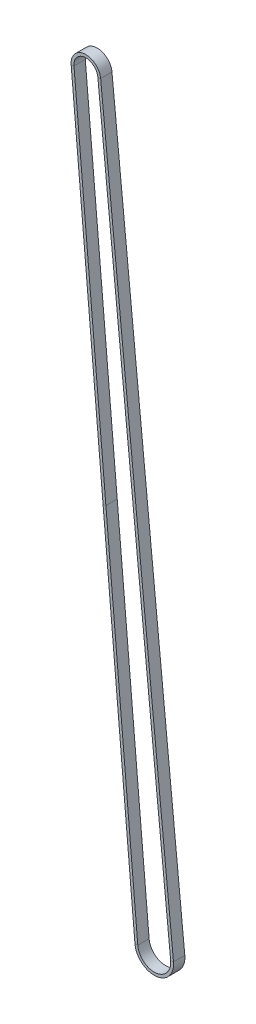
ISO-10303-21;
HEADER;
FILE_DESCRIPTION(('STEP AP214'),'2;1');
FILE_NAME('part.step','',(''),(''),'','','');
FILE_SCHEMA(('AUTOMOTIVE_DESIGN { 1 0 10303 214 1 1 1 1 }'));
ENDSEC;
DATA;
#1=APPLICATION_CONTEXT('core data for automotive mechanical design processes');
#2=APPLICATION_PROTOCOL_DEFINITION('international standard','automotive_design',2000,#1);
#3=PRODUCT_CONTEXT('',#1,'mechanical');
#4=PRODUCT('Part','Part','',(#3));
#5=PRODUCT_RELATED_PRODUCT_CATEGORY('part','',(#4));
#6=PRODUCT_DEFINITION_FORMATION('','',#4);
#7=PRODUCT_DEFINITION_CONTEXT('part definition',#1,'design');
#8=PRODUCT_DEFINITION('design','',#6,#7);
#9=PRODUCT_DEFINITION_SHAPE('','',#8);
#10=(LENGTH_UNIT() NAMED_UNIT(*) SI_UNIT(.MILLI.,.METRE.));
#11=(NAMED_UNIT(*) PLANE_ANGLE_UNIT() SI_UNIT($,.RADIAN.));
#12=(NAMED_UNIT(*) SI_UNIT($,.STERADIAN.) SOLID_ANGLE_UNIT());
#13=UNCERTAINTY_MEASURE_WITH_UNIT(LENGTH_MEASURE(1.E-05),#10,'distance_accuracy_value','');
#14=(GEOMETRIC_REPRESENTATION_CONTEXT(3) GLOBAL_UNCERTAINTY_ASSIGNED_CONTEXT((#13)) GLOBAL_UNIT_ASSIGNED_CONTEXT((#10,
#11,#12)) REPRESENTATION_CONTEXT('',''));
#15=CARTESIAN_POINT('',(0.,0.,0.));
#16=DIRECTION('',(0.,0.,1.));
#17=DIRECTION('',(1.,0.,0.));
#18=AXIS2_PLACEMENT_3D('',#15,#16,#17);
#19=CARTESIAN_POINT('',(-8.71671022717486,-0.762537091199472,-3.));
#20=DIRECTION('',(-0.996195454534337,-0.087147096137086,0.));
#21=DIRECTION('',(0.087147096137086,-0.996195454534337,0.));
#22=AXIS2_PLACEMENT_3D('',#19,#20,#21);
#23=PLANE('',#22);
#24=DIRECTION('',(0.,0.,1.));
#25=VECTOR('',#24,1.);
#26=CARTESIAN_POINT('',(-8.71671022717778,-0.762537091199972,-3.));
#27=LINE('',#26,#25);
#28=CARTESIAN_POINT('',(-8.71671022717483,-0.762537091199717,-3.));
#29=VERTEX_POINT('',#28);
#30=CARTESIAN_POINT('',(-8.71671022717483,-0.762537091199717,3.));
#31=VERTEX_POINT('',#30);
#32=EDGE_CURVE('E167',#29,#31,#27,.T.);
#33=ORIENTED_EDGE('',*,*,#32,.F.);
#34=DIRECTION('',(-0.0871470961370859,0.996195454534336,0.));
#35=VECTOR('',#34,1.);
#36=CARTESIAN_POINT('',(-8.71671022717486,-0.762537091199472,-3.));
#37=LINE('',#36,#35);
#38=CARTESIAN_POINT('',(-25.6232468776201,192.499381086754,-3.));
#39=VERTEX_POINT('',#38);
#40=EDGE_CURVE('E166',#29,#39,#37,.T.);
#41=ORIENTED_EDGE('',*,*,#40,.T.);
#42=DIRECTION('',(0.,0.,1.));
#43=VECTOR('',#42,1.);
#44=CARTESIAN_POINT('',(-25.6232468776201,192.499381086754,-3.));
#45=LINE('',#44,#43);
#46=CARTESIAN_POINT('',(-25.6232468776201,192.499381086754,3.));
#47=VERTEX_POINT('',#46);
#48=EDGE_CURVE('E141',#39,#47,#45,.T.);
#49=ORIENTED_EDGE('',*,*,#48,.T.);
#50=DIRECTION('',(-0.0871470961370859,0.996195454534336,0.));
#51=VECTOR('',#50,1.);
#52=CARTESIAN_POINT('',(-8.71671022717486,-0.762537091199472,3.));
#53=LINE('',#52,#51);
#54=EDGE_CURVE('E171',#31,#47,#53,.T.);
#55=ORIENTED_EDGE('',*,*,#54,.F.);
#56=EDGE_LOOP('',(#33,#41,#49,#55));
#57=FACE_BOUND('',#56,.T.);
#58=ADVANCED_FACE('F33',(#57),#23,.F.);
#59=CARTESIAN_POINT('',(-25.6232468776201,192.499381086754,-3.));
#60=DIRECTION('',(-0.996195454534337,-0.087147096137086,0.));
#61=DIRECTION('',(0.087147096137086,-0.996195454534337,0.));
#62=AXIS2_PLACEMENT_3D('',#59,#60,#61);
#63=PLANE('',#62);
#64=DIRECTION('',(-0.0871470961370859,0.996195454534336,0.));
#65=VECTOR('',#64,1.);
#66=CARTESIAN_POINT('',(-25.6232468776201,192.499381086754,3.));
#67=LINE('',#66,#65);
#68=CARTESIAN_POINT('',(-42.5297835280654,385.761299264707,3.));
#69=VERTEX_POINT('',#68);
#70=EDGE_CURVE('E147',#47,#69,#67,.T.);
#71=ORIENTED_EDGE('',*,*,#70,.F.);
#72=ORIENTED_EDGE('',*,*,#48,.F.);
#73=DIRECTION('',(-0.0871470961370859,0.996195454534336,0.));
#74=VECTOR('',#73,1.);
#75=CARTESIAN_POINT('',(-25.6232468776201,192.499381086754,-3.));
#76=LINE('',#75,#74);
#77=CARTESIAN_POINT('',(-42.5297835280654,385.761299264707,-3.));
#78=VERTEX_POINT('',#77);
#79=EDGE_CURVE('E145',#39,#78,#76,.T.);
#80=ORIENTED_EDGE('',*,*,#79,.T.);
#81=DIRECTION('',(0.,0.,1.));
#82=VECTOR('',#81,1.);
#83=CARTESIAN_POINT('',(-42.5297835280654,385.761299264707,-3.));
#84=LINE('',#83,#82);
#85=EDGE_CURVE('E163',#78,#69,#84,.T.);
#86=ORIENTED_EDGE('',*,*,#85,.T.);
#87=EDGE_LOOP('',(#71,#72,#80,#86));
#88=FACE_BOUND('',#87,.T.);
#89=ADVANCED_FACE('F143',(#88),#63,.F.);
#90=CARTESIAN_POINT('',(-27.1175400594216,192.368660442548,3.));
#91=DIRECTION('',(0.,0.,-1.));
#92=DIRECTION('',(-1.,0.,0.));
#93=AXIS2_PLACEMENT_3D('',#90,#91,#92);
#94=PLANE('',#93);
#95=DIRECTION('',(-0.0871470961370859,0.996195454534336,0.));
#96=VECTOR('',#95,1.);
#97=CARTESIAN_POINT('',(-27.1175400594216,192.368660442548,3.));
#98=LINE('',#97,#96);
#99=CARTESIAN_POINT('',(-27.1175400594216,192.368660442548,3.));
#100=VERTEX_POINT('',#99);
#101=CARTESIAN_POINT('',(-44.0240767098669,385.630578620502,3.));
#102=VERTEX_POINT('',#101);
#103=EDGE_CURVE('E212',#100,#102,#98,.T.);
#104=ORIENTED_EDGE('',*,*,#103,.F.);
#105=DIRECTION('',(-0.996195454534336,-0.0871470961370894,0.));
#106=VECTOR('',#105,1.);
#107=CARTESIAN_POINT('',(-27.1175400594216,192.368660442548,3.));
#108=LINE('',#107,#106);
#109=EDGE_CURVE('E152',#47,#100,#108,.T.);
#110=ORIENTED_EDGE('',*,*,#109,.F.);
#111=ORIENTED_EDGE('',*,*,#70,.T.);
#112=DIRECTION('',(-0.996195454534336,-0.0871470961370894,0.));
#113=VECTOR('',#112,1.);
#114=CARTESIAN_POINT('',(-44.0240767098669,385.630578620502,3.));
#115=LINE('',#114,#113);
#116=EDGE_CURVE('E237',#69,#102,#115,.T.);
#117=ORIENTED_EDGE('',*,*,#116,.T.);
#118=EDGE_LOOP('',(#104,#110,#111,#117));
#119=FACE_BOUND('',#118,.T.);
#120=ADVANCED_FACE('F257',(#119),#94,.F.);
#121=CARTESIAN_POINT('',(-27.1175400594216,192.368660442548,-3.));
#122=DIRECTION('',(0.996195454534337,0.087147096137086,0.));
#123=DIRECTION('',(-0.087147096137086,0.996195454534337,0.));
#124=AXIS2_PLACEMENT_3D('',#121,#122,#123);
#125=PLANE('',#124);
#126=DIRECTION('',(-0.0871470961370859,0.996195454534336,0.));
#127=VECTOR('',#126,1.);
#128=CARTESIAN_POINT('',(-27.1175400594216,192.368660442548,-3.));
#129=LINE('',#128,#127);
#130=CARTESIAN_POINT('',(-27.1175400594216,192.368660442548,-3.));
#131=VERTEX_POINT('',#130);
#132=CARTESIAN_POINT('',(-44.0240767098669,385.630578620502,-3.));
#133=VERTEX_POINT('',#132);
#134=EDGE_CURVE('E182',#131,#133,#129,.T.);
#135=ORIENTED_EDGE('',*,*,#134,.F.);
#136=DIRECTION('',(0.,0.,-1.));
#137=VECTOR('',#136,1.);
#138=CARTESIAN_POINT('',(-27.1175400594216,192.368660442548,-3.));
#139=LINE('',#138,#137);
#140=EDGE_CURVE('E174',#100,#131,#139,.T.);
#141=ORIENTED_EDGE('',*,*,#140,.F.);
#142=ORIENTED_EDGE('',*,*,#103,.T.);
#143=DIRECTION('',(0.,0.,-1.));
#144=VECTOR('',#143,1.);
#145=CARTESIAN_POINT('',(-44.0240767098669,385.630578620502,-3.));
#146=LINE('',#145,#144);
#147=EDGE_CURVE('E214',#102,#133,#146,.T.);
#148=ORIENTED_EDGE('',*,*,#147,.T.);
#149=EDGE_LOOP('',(#135,#141,#142,#148));
#150=FACE_BOUND('',#149,.T.);
#151=ADVANCED_FACE('F210',(#150),#125,.F.);
#152=CARTESIAN_POINT('',(-27.1175400594216,192.368660442548,-3.));
#153=DIRECTION('',(0.,0.,1.));
#154=DIRECTION('',(1.,0.,0.));
#155=AXIS2_PLACEMENT_3D('',#152,#153,#154);
#156=PLANE('',#155);
#157=DIRECTION('',(0.996195454534336,0.0871470961370894,0.));
#158=VECTOR('',#157,1.);
#159=CARTESIAN_POINT('',(-44.0240767098669,385.630578620502,-3.));
#160=LINE('',#159,#158);
#161=EDGE_CURVE('E161',#133,#78,#160,.T.);
#162=ORIENTED_EDGE('',*,*,#161,.T.);
#163=ORIENTED_EDGE('',*,*,#79,.F.);
#164=DIRECTION('',(0.996195454534336,0.0871470961370894,0.));
#165=VECTOR('',#164,1.);
#166=CARTESIAN_POINT('',(-27.1175400594216,192.368660442548,-3.));
#167=LINE('',#166,#165);
#168=EDGE_CURVE('E159',#131,#39,#167,.T.);
#169=ORIENTED_EDGE('',*,*,#168,.F.);
#170=ORIENTED_EDGE('',*,*,#134,.T.);
#171=EDGE_LOOP('',(#162,#163,#169,#170));
#172=FACE_BOUND('',#171,.T.);
#173=ADVANCED_FACE('F157',(#172),#156,.F.);
#174=CARTESIAN_POINT('',(-36.2039423917724,386.314683325178,0.));
#175=DIRECTION('',(0.,0.,-1.));
#176=DIRECTION('',(-1.,0.,0.));
#177=AXIS2_PLACEMENT_3D('',#174,#175,#176);
#178=CYLINDRICAL_SURFACE('',#177,6.34999999999962);
#179=CARTESIAN_POINT('',(-36.2039423917724,386.314683325178,3.));
#180=DIRECTION('',(0.,0.,-1.));
#181=DIRECTION('',(-0.996195454534334,-0.0871470961371192,0.));
#182=AXIS2_PLACEMENT_3D('',#179,#180,#181);
#183=CIRCLE('',#182,6.34999999999962);
#184=CARTESIAN_POINT('',(-29.8854310324526,386.946279875313,3.));
#185=VERTEX_POINT('',#184);
#186=EDGE_CURVE('E126',#69,#185,#183,.T.);
#187=ORIENTED_EDGE('',*,*,#186,.F.);
#188=ORIENTED_EDGE('',*,*,#85,.F.);
#189=CARTESIAN_POINT('',(-36.2039423917724,386.314683325178,-3.));
#190=DIRECTION('',(0.,0.,-1.));
#191=DIRECTION('',(-0.996195454534334,-0.0871470961371192,0.));
#192=AXIS2_PLACEMENT_3D('',#189,#190,#191);
#193=CIRCLE('',#192,6.34999999999962);
#194=CARTESIAN_POINT('',(-29.8854310324526,386.946279875313,-3.));
#195=VERTEX_POINT('',#194);
#196=EDGE_CURVE('E181',#78,#195,#193,.T.);
#197=ORIENTED_EDGE('',*,*,#196,.T.);
#198=DIRECTION('',(0.,0.,1.));
#199=VECTOR('',#198,1.);
#200=CARTESIAN_POINT('',(-29.8854310324522,386.946279875313,-3.));
#201=LINE('',#200,#199);
#202=EDGE_CURVE('E242',#195,#185,#201,.T.);
#203=ORIENTED_EDGE('',*,*,#202,.T.);
#204=EDGE_LOOP('',(#187,#188,#197,#203));
#205=FACE_BOUND('',#204,.T.);
#206=ADVANCED_FACE('F282',(#205),#178,.F.);
#207=CARTESIAN_POINT('',(-44.0240767098665,385.630578620502,3.));
#208=DIRECTION('',(0.,0.,-1.));
#209=DIRECTION('',(-1.,0.,0.));
#210=AXIS2_PLACEMENT_3D('',#207,#208,#209);
#211=PLANE('',#210);
#212=CARTESIAN_POINT('',(-36.2039423917724,386.314683325178,3.));
#213=DIRECTION('',(0.,0.,-1.));
#214=DIRECTION('',(-0.996195454534334,-0.0871470961371099,0.));
#215=AXIS2_PLACEMENT_3D('',#212,#213,#214);
#216=CIRCLE('',#215,7.84999999999963);
#217=CARTESIAN_POINT('',(-28.3928692940305,387.095475910778,3.));
#218=VERTEX_POINT('',#217);
#219=EDGE_CURVE('E120',#102,#218,#216,.T.);
#220=ORIENTED_EDGE('',*,*,#219,.F.);
#221=ORIENTED_EDGE('',*,*,#116,.F.);
#222=ORIENTED_EDGE('',*,*,#186,.T.);
#223=DIRECTION('',(0.995041158948055,0.0994640236432764,0.));
#224=VECTOR('',#223,1.);
#225=CARTESIAN_POINT('',(-28.3928692940302,387.095475910778,3.));
#226=LINE('',#225,#224);
#227=EDGE_CURVE('E219',#185,#218,#226,.T.);
#228=ORIENTED_EDGE('',*,*,#227,.T.);
#229=EDGE_LOOP('',(#220,#221,#222,#228));
#230=FACE_BOUND('',#229,.T.);
#231=ADVANCED_FACE('F284',(#230),#211,.F.);
#232=CARTESIAN_POINT('',(-36.2039423917724,386.314683325178,0.));
#233=DIRECTION('',(0.,0.,-1.));
#234=DIRECTION('',(-1.,0.,0.));
#235=AXIS2_PLACEMENT_3D('',#232,#233,#234);
#236=CYLINDRICAL_SURFACE('',#235,7.84999999999963);
#237=CARTESIAN_POINT('',(-36.2039423917724,386.314683325178,-3.));
#238=DIRECTION('',(0.,0.,-1.));
#239=DIRECTION('',(-0.996195454534334,-0.0871470961371099,0.));
#240=AXIS2_PLACEMENT_3D('',#237,#238,#239);
#241=CIRCLE('',#240,7.84999999999963);
#242=CARTESIAN_POINT('',(-28.3928692940305,387.095475910778,-3.));
#243=VERTEX_POINT('',#242);
#244=EDGE_CURVE('E186',#133,#243,#241,.T.);
#245=ORIENTED_EDGE('',*,*,#244,.F.);
#246=ORIENTED_EDGE('',*,*,#147,.F.);
#247=ORIENTED_EDGE('',*,*,#219,.T.);
#248=DIRECTION('',(0.,0.,-1.));
#249=VECTOR('',#248,1.);
#250=CARTESIAN_POINT('',(-28.3928692940302,387.095475910778,-3.));
#251=LINE('',#250,#249);
#252=EDGE_CURVE('E218',#218,#243,#251,.T.);
#253=ORIENTED_EDGE('',*,*,#252,.T.);
#254=EDGE_LOOP('',(#245,#246,#247,#253));
#255=FACE_BOUND('',#254,.T.);
#256=ADVANCED_FACE('F290',(#255),#236,.T.);
#257=CARTESIAN_POINT('',(-44.0240767098665,385.630578620502,-3.));
#258=DIRECTION('',(0.,0.,1.));
#259=DIRECTION('',(1.,0.,0.));
#260=AXIS2_PLACEMENT_3D('',#257,#258,#259);
#261=PLANE('',#260);
#262=DIRECTION('',(-0.995041158948055,-0.0994640236432764,0.));
#263=VECTOR('',#262,1.);
#264=CARTESIAN_POINT('',(-28.3928692940302,387.095475910778,-3.));
#265=LINE('',#264,#263);
#266=EDGE_CURVE('E183',#243,#195,#265,.T.);
#267=ORIENTED_EDGE('',*,*,#266,.T.);
#268=ORIENTED_EDGE('',*,*,#196,.F.);
#269=ORIENTED_EDGE('',*,*,#161,.F.);
#270=ORIENTED_EDGE('',*,*,#244,.T.);
#271=EDGE_LOOP('',(#267,#268,#269,#270));
#272=FACE_BOUND('',#271,.T.);
#273=ADVANCED_FACE('F280',(#272),#261,.F.);
#274=CARTESIAN_POINT('',(-29.8854310324522,386.946279875313,-3.));
#275=DIRECTION('',(0.995041158948056,0.0994640236432714,0.));
#276=DIRECTION('',(-0.0994640236432715,0.995041158948056,0.));
#277=AXIS2_PLACEMENT_3D('',#274,#275,#276);
#278=PLANE('',#277);
#279=DIRECTION('',(0.0994640236432715,-0.995041158948056,0.));
#280=VECTOR('',#279,1.);
#281=CARTESIAN_POINT('',(-29.8854310324522,386.946279875313,3.));
#282=LINE('',#281,#280);
#283=CARTESIAN_POINT('',(8.70661014079606,0.870310206878833,3.));
#284=VERTEX_POINT('',#283);
#285=EDGE_CURVE('E103',#185,#284,#282,.T.);
#286=ORIENTED_EDGE('',*,*,#285,.F.);
#287=ORIENTED_EDGE('',*,*,#202,.F.);
#288=DIRECTION('',(0.0994640236432715,-0.995041158948056,0.));
#289=VECTOR('',#288,1.);
#290=CARTESIAN_POINT('',(-29.8854310324522,386.946279875313,-3.));
#291=LINE('',#290,#289);
#292=CARTESIAN_POINT('',(8.70661014079606,0.870310206878833,-3.));
#293=VERTEX_POINT('',#292);
#294=EDGE_CURVE('E185',#195,#293,#291,.T.);
#295=ORIENTED_EDGE('',*,*,#294,.T.);
#296=DIRECTION('',(0.,0.,1.));
#297=VECTOR('',#296,1.);
#298=CARTESIAN_POINT('',(8.70661014079606,0.870310206878833,-3.));
#299=LINE('',#298,#297);
#300=EDGE_CURVE('E195',#293,#284,#299,.T.);
#301=ORIENTED_EDGE('',*,*,#300,.T.);
#302=EDGE_LOOP('',(#286,#287,#295,#301));
#303=FACE_BOUND('',#302,.T.);
#304=ADVANCED_FACE('F276',(#303),#278,.F.);
#305=CARTESIAN_POINT('',(-28.3928692940302,387.095475910778,3.));
#306=DIRECTION('',(0.,0.,-1.));
#307=DIRECTION('',(-1.,0.,0.));
#308=AXIS2_PLACEMENT_3D('',#305,#306,#307);
#309=PLANE('',#308);
#310=DIRECTION('',(0.0994640236432715,-0.995041158948056,0.));
#311=VECTOR('',#310,1.);
#312=CARTESIAN_POINT('',(-28.3928692940302,387.095475910778,3.));
#313=LINE('',#312,#311);
#314=CARTESIAN_POINT('',(10.1991718792181,1.01950624234376,3.));
#315=VERTEX_POINT('',#314);
#316=EDGE_CURVE('E96',#218,#315,#313,.T.);
#317=ORIENTED_EDGE('',*,*,#316,.F.);
#318=ORIENTED_EDGE('',*,*,#227,.F.);
#319=ORIENTED_EDGE('',*,*,#285,.T.);
#320=DIRECTION('',(0.995041158948056,0.0994640236432749,0.));
#321=VECTOR('',#320,1.);
#322=CARTESIAN_POINT('',(10.1991718792181,1.01950624234376,3.));
#323=LINE('',#322,#321);
#324=EDGE_CURVE('E193',#284,#315,#323,.T.);
#325=ORIENTED_EDGE('',*,*,#324,.T.);
#326=EDGE_LOOP('',(#317,#318,#319,#325));
#327=FACE_BOUND('',#326,.T.);
#328=ADVANCED_FACE('F279',(#327),#309,.F.);
#329=CARTESIAN_POINT('',(-28.3928692940302,387.095475910778,-3.));
#330=DIRECTION('',(-0.995041158948056,-0.0994640236432714,0.));
#331=DIRECTION('',(0.0994640236432715,-0.995041158948056,0.));
#332=AXIS2_PLACEMENT_3D('',#329,#330,#331);
#333=PLANE('',#332);
#334=DIRECTION('',(0.0994640236432715,-0.995041158948056,0.));
#335=VECTOR('',#334,1.);
#336=CARTESIAN_POINT('',(-28.3928692940302,387.095475910778,-3.));
#337=LINE('',#336,#335);
#338=CARTESIAN_POINT('',(10.1991718792181,1.01950624234376,-3.));
#339=VERTEX_POINT('',#338);
#340=EDGE_CURVE('E87',#243,#339,#337,.T.);
#341=ORIENTED_EDGE('',*,*,#340,.F.);
#342=ORIENTED_EDGE('',*,*,#252,.F.);
#343=ORIENTED_EDGE('',*,*,#316,.T.);
#344=DIRECTION('',(0.,0.,-1.));
#345=VECTOR('',#344,1.);
#346=CARTESIAN_POINT('',(10.1991718792181,1.01950624234376,-3.));
#347=LINE('',#346,#345);
#348=EDGE_CURVE('E189',#315,#339,#347,.T.);
#349=ORIENTED_EDGE('',*,*,#348,.T.);
#350=EDGE_LOOP('',(#341,#342,#343,#349));
#351=FACE_BOUND('',#350,.T.);
#352=ADVANCED_FACE('F294',(#351),#333,.F.);
#353=CARTESIAN_POINT('',(-28.3928692940302,387.095475910778,-3.));
#354=DIRECTION('',(0.,0.,1.));
#355=DIRECTION('',(1.,0.,0.));
#356=AXIS2_PLACEMENT_3D('',#353,#354,#355);
#357=PLANE('',#356);
#358=DIRECTION('',(-0.995041158948056,-0.0994640236432749,0.));
#359=VECTOR('',#358,1.);
#360=CARTESIAN_POINT('',(10.1991718792181,1.01950624234376,-3.));
#361=LINE('',#360,#359);
#362=EDGE_CURVE('E187',#339,#293,#361,.T.);
#363=ORIENTED_EDGE('',*,*,#362,.T.);
#364=ORIENTED_EDGE('',*,*,#294,.F.);
#365=ORIENTED_EDGE('',*,*,#266,.F.);
#366=ORIENTED_EDGE('',*,*,#340,.T.);
#367=EDGE_LOOP('',(#363,#364,#365,#366));
#368=FACE_BOUND('',#367,.T.);
#369=ADVANCED_FACE('F275',(#368),#357,.F.);
#370=CARTESIAN_POINT('',(5.96221521871182E-13,0.,0.));
#371=DIRECTION('',(0.,0.,-1.));
#372=DIRECTION('',(-1.,0.,0.));
#373=AXIS2_PLACEMENT_3D('',#370,#371,#372);
#374=CYLINDRICAL_SURFACE('',#373,8.75);
#375=CARTESIAN_POINT('',(5.96221521871182E-13,0.,3.));
#376=DIRECTION('',(0.,0.,-1.));
#377=DIRECTION('',(0.995041158948053,0.0994640236432979,0.));
#378=AXIS2_PLACEMENT_3D('',#375,#376,#377);
#379=CIRCLE('',#378,8.75);
#380=EDGE_CURVE('E227',#284,#31,#379,.T.);
#381=ORIENTED_EDGE('',*,*,#380,.F.);
#382=ORIENTED_EDGE('',*,*,#300,.F.);
#383=CARTESIAN_POINT('',(5.96221521871182E-13,0.,-3.));
#384=DIRECTION('',(0.,0.,-1.));
#385=DIRECTION('',(0.995041158948053,0.0994640236432979,0.));
#386=AXIS2_PLACEMENT_3D('',#383,#384,#385);
#387=CIRCLE('',#386,8.75);
#388=EDGE_CURVE('E188',#293,#29,#387,.T.);
#389=ORIENTED_EDGE('',*,*,#388,.T.);
#390=ORIENTED_EDGE('',*,*,#32,.T.);
#391=EDGE_LOOP('',(#381,#382,#389,#390));
#392=FACE_BOUND('',#391,.T.);
#393=ADVANCED_FACE('F272',(#392),#374,.F.);
#394=CARTESIAN_POINT('',(10.1991718792181,1.01950624234373,3.));
#395=DIRECTION('',(0.,0.,-1.));
#396=DIRECTION('',(-1.,0.,0.));
#397=AXIS2_PLACEMENT_3D('',#394,#395,#396);
#398=PLANE('',#397);
#399=CARTESIAN_POINT('',(5.96221521871182E-13,0.,3.));
#400=DIRECTION('',(0.,0.,-1.));
#401=DIRECTION('',(0.995041158948054,0.0994640236432933,0.));
#402=AXIS2_PLACEMENT_3D('',#399,#400,#401);
#403=CIRCLE('',#402,10.25);
#404=CARTESIAN_POINT('',(-10.2110034089763,-0.893257735405349,3.));
#405=VERTEX_POINT('',#404);
#406=EDGE_CURVE('E58',#315,#405,#403,.T.);
#407=ORIENTED_EDGE('',*,*,#406,.F.);
#408=ORIENTED_EDGE('',*,*,#324,.F.);
#409=ORIENTED_EDGE('',*,*,#380,.T.);
#410=DIRECTION('',(-0.996195454534336,-0.0871470961370894,0.));
#411=VECTOR('',#410,1.);
#412=CARTESIAN_POINT('',(-10.2110034089793,-0.893257735405606,3.));
#413=LINE('',#412,#411);
#414=EDGE_CURVE('E225',#31,#405,#413,.T.);
#415=ORIENTED_EDGE('',*,*,#414,.T.);
#416=EDGE_LOOP('',(#407,#408,#409,#415));
#417=FACE_BOUND('',#416,.T.);
#418=ADVANCED_FACE('F253',(#417),#398,.F.);
#419=CARTESIAN_POINT('',(5.96221521871182E-13,0.,0.));
#420=DIRECTION('',(0.,0.,-1.));
#421=DIRECTION('',(-1.,0.,0.));
#422=AXIS2_PLACEMENT_3D('',#419,#420,#421);
#423=CYLINDRICAL_SURFACE('',#422,10.25);
#424=CARTESIAN_POINT('',(5.96221521871182E-13,0.,-3.));
#425=DIRECTION('',(0.,0.,-1.));
#426=DIRECTION('',(0.995041158948054,0.0994640236432933,0.));
#427=AXIS2_PLACEMENT_3D('',#424,#425,#426);
#428=CIRCLE('',#427,10.25);
#429=CARTESIAN_POINT('',(-10.2110034089763,-0.893257735405349,-3.));
#430=VERTEX_POINT('',#429);
#431=EDGE_CURVE('E50',#339,#430,#428,.T.);
#432=ORIENTED_EDGE('',*,*,#431,.F.);
#433=ORIENTED_EDGE('',*,*,#348,.F.);
#434=ORIENTED_EDGE('',*,*,#406,.T.);
#435=DIRECTION('',(0.,0.,-1.));
#436=VECTOR('',#435,1.);
#437=CARTESIAN_POINT('',(-10.2110034089793,-0.893257735405606,-3.));
#438=LINE('',#437,#436);
#439=EDGE_CURVE('E201',#405,#430,#438,.T.);
#440=ORIENTED_EDGE('',*,*,#439,.T.);
#441=EDGE_LOOP('',(#432,#433,#434,#440));
#442=FACE_BOUND('',#441,.T.);
#443=ADVANCED_FACE('F303',(#442),#423,.T.);
#444=CARTESIAN_POINT('',(10.1991718792181,1.01950624234373,-3.));
#445=DIRECTION('',(0.,0.,1.));
#446=DIRECTION('',(1.,0.,0.));
#447=AXIS2_PLACEMENT_3D('',#444,#445,#446);
#448=PLANE('',#447);
#449=DIRECTION('',(0.996195454534336,0.0871470961370894,0.));
#450=VECTOR('',#449,1.);
#451=CARTESIAN_POINT('',(-10.2110034089793,-0.893257735405606,-3.));
#452=LINE('',#451,#450);
#453=EDGE_CURVE('E37',#430,#29,#452,.T.);
#454=ORIENTED_EDGE('',*,*,#453,.T.);
#455=ORIENTED_EDGE('',*,*,#388,.F.);
#456=ORIENTED_EDGE('',*,*,#362,.F.);
#457=ORIENTED_EDGE('',*,*,#431,.T.);
#458=EDGE_LOOP('',(#454,#455,#456,#457));
#459=FACE_BOUND('',#458,.T.);
#460=ADVANCED_FACE('F202',(#459),#448,.F.);
#461=CARTESIAN_POINT('',(-10.2110034089764,-0.893257735405106,3.));
#462=DIRECTION('',(0.,0.,-1.));
#463=DIRECTION('',(-1.,0.,0.));
#464=AXIS2_PLACEMENT_3D('',#461,#462,#463);
#465=PLANE('',#464);
#466=ORIENTED_EDGE('',*,*,#54,.T.);
#467=ORIENTED_EDGE('',*,*,#109,.T.);
#468=DIRECTION('',(-0.0871470961370859,0.996195454534336,0.));
#469=VECTOR('',#468,1.);
#470=CARTESIAN_POINT('',(-10.2110034089764,-0.893257735405106,3.));
#471=LINE('',#470,#469);
#472=EDGE_CURVE('E42',#405,#100,#471,.T.);
#473=ORIENTED_EDGE('',*,*,#472,.F.);
#474=ORIENTED_EDGE('',*,*,#414,.F.);
#475=EDGE_LOOP('',(#466,#467,#473,#474));
#476=FACE_BOUND('',#475,.T.);
#477=ADVANCED_FACE('F256',(#476),#465,.F.);
#478=CARTESIAN_POINT('',(-10.2110034089764,-0.893257735405106,-3.));
#479=DIRECTION('',(0.996195454534337,0.087147096137086,0.));
#480=DIRECTION('',(-0.087147096137086,0.996195454534337,0.));
#481=AXIS2_PLACEMENT_3D('',#478,#479,#480);
#482=PLANE('',#481);
#483=ORIENTED_EDGE('',*,*,#472,.T.);
#484=ORIENTED_EDGE('',*,*,#140,.T.);
#485=DIRECTION('',(-0.0871470961370859,0.996195454534336,0.));
#486=VECTOR('',#485,1.);
#487=CARTESIAN_POINT('',(-10.2110034089764,-0.893257735405106,-3.));
#488=LINE('',#487,#486);
#489=EDGE_CURVE('E11',#430,#131,#488,.T.);
#490=ORIENTED_EDGE('',*,*,#489,.F.);
#491=ORIENTED_EDGE('',*,*,#439,.F.);
#492=EDGE_LOOP('',(#483,#484,#490,#491));
#493=FACE_BOUND('',#492,.T.);
#494=ADVANCED_FACE('F206',(#493),#482,.F.);
#495=CARTESIAN_POINT('',(-10.2110034089764,-0.893257735405106,-3.));
#496=DIRECTION('',(0.,0.,1.));
#497=DIRECTION('',(1.,0.,0.));
#498=AXIS2_PLACEMENT_3D('',#495,#496,#497);
#499=PLANE('',#498);
#500=ORIENTED_EDGE('',*,*,#489,.T.);
#501=ORIENTED_EDGE('',*,*,#168,.T.);
#502=ORIENTED_EDGE('',*,*,#40,.F.);
#503=ORIENTED_EDGE('',*,*,#453,.F.);
#504=EDGE_LOOP('',(#500,#501,#502,#503));
#505=FACE_BOUND('',#504,.T.);
#506=ADVANCED_FACE('F35',(#505),#499,.F.);
#507=CLOSED_SHELL('',(#58,#89,#120,#151,#173,#206,#231,#256,#273,#304,#328,#352,#369,#393,#418,
#443,#460,#477,#494,#506));
#508=MANIFOLD_SOLID_BREP('B2',#507);
#509=ADVANCED_BREP_SHAPE_REPRESENTATION('',(#18,#508),#14);
#510=SHAPE_DEFINITION_REPRESENTATION(#9,#509);
ENDSEC;
END-ISO-10303-21;
